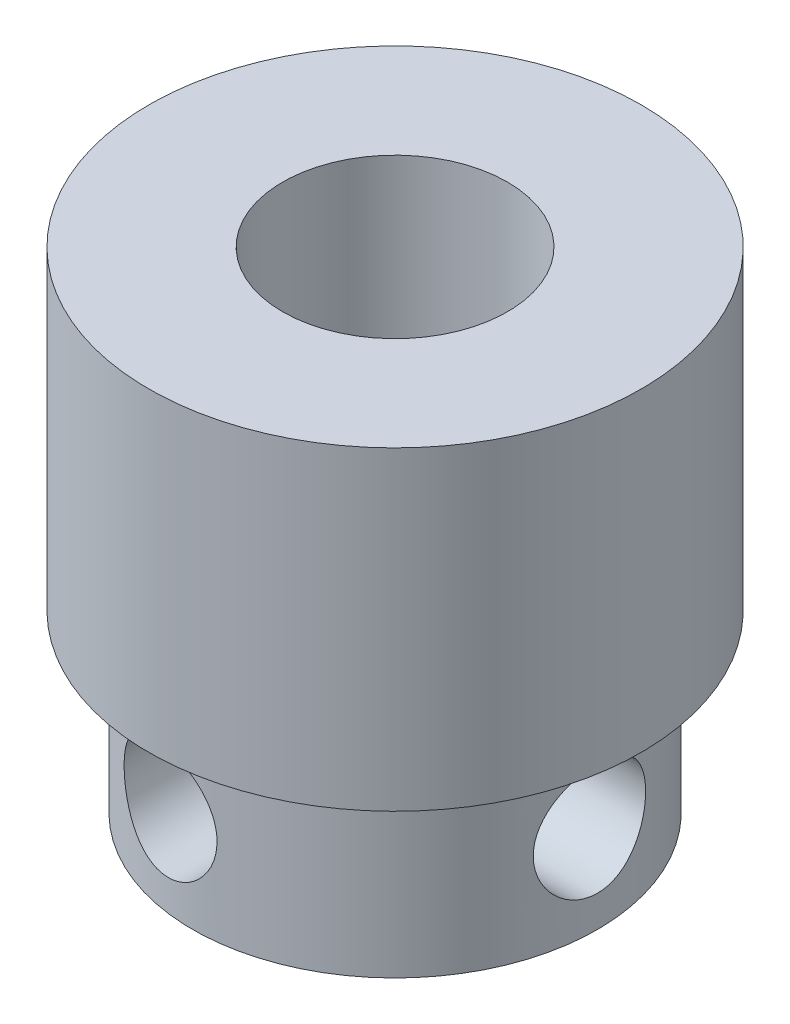
ISO-10303-21;
HEADER;
FILE_DESCRIPTION(('STEP AP214'),'2;1');
FILE_NAME('part.step','',(''),(''),'','','');
FILE_SCHEMA(('AUTOMOTIVE_DESIGN { 1 0 10303 214 1 1 1 1 }'));
ENDSEC;
DATA;
#1=APPLICATION_CONTEXT('core data for automotive mechanical design processes');
#2=APPLICATION_PROTOCOL_DEFINITION('international standard','automotive_design',2000,#1);
#3=PRODUCT_CONTEXT('',#1,'mechanical');
#4=PRODUCT('Part','Part','',(#3));
#5=PRODUCT_RELATED_PRODUCT_CATEGORY('part','',(#4));
#6=PRODUCT_DEFINITION_FORMATION('','',#4);
#7=PRODUCT_DEFINITION_CONTEXT('part definition',#1,'design');
#8=PRODUCT_DEFINITION('design','',#6,#7);
#9=PRODUCT_DEFINITION_SHAPE('','',#8);
#10=(LENGTH_UNIT() NAMED_UNIT(*) SI_UNIT(.MILLI.,.METRE.));
#11=(NAMED_UNIT(*) PLANE_ANGLE_UNIT() SI_UNIT($,.RADIAN.));
#12=(NAMED_UNIT(*) SI_UNIT($,.STERADIAN.) SOLID_ANGLE_UNIT());
#13=UNCERTAINTY_MEASURE_WITH_UNIT(LENGTH_MEASURE(1.E-05),#10,'distance_accuracy_value','');
#14=(GEOMETRIC_REPRESENTATION_CONTEXT(3) GLOBAL_UNCERTAINTY_ASSIGNED_CONTEXT((#13)) GLOBAL_UNIT_ASSIGNED_CONTEXT((#10,
#11,#12)) REPRESENTATION_CONTEXT('',''));
#15=CARTESIAN_POINT('',(0.,0.,0.));
#16=DIRECTION('',(0.,0.,1.));
#17=DIRECTION('',(1.,0.,0.));
#18=AXIS2_PLACEMENT_3D('',#15,#16,#17);
#19=CARTESIAN_POINT('',(74.7610003334919,47.4594238491086,-56.4));
#20=DIRECTION('',(0.,0.,1.));
#21=DIRECTION('',(1.,0.,0.));
#22=AXIS2_PLACEMENT_3D('',#19,#20,#21);
#23=CYLINDRICAL_SURFACE('',#22,1.25);
#24=CARTESIAN_POINT('',(76.0110003334919,47.4594238491086,-51.9291076216072));
#25=CARTESIAN_POINT('',(76.0109968876448,47.3893945585765,-51.9291056542091));
#26=CARTESIAN_POINT('',(76.0050929075244,47.319294653499,-51.9284201602777));
#27=CARTESIAN_POINT('',(75.9816245272522,47.1810183488735,-51.9258328790443));
#28=CARTESIAN_POINT('',(75.964040810737,47.1128453311288,-51.9239290770523));
#29=CARTESIAN_POINT('',(75.9177311494876,46.9804846795561,-51.9193707372766));
#30=CARTESIAN_POINT('',(75.8890154096498,46.9162934578928,-51.916716887675));
#31=CARTESIAN_POINT('',(75.8212578438801,46.7936443649985,-51.9113540049157));
#32=CARTESIAN_POINT('',(75.7822189833599,46.7351848538808,-51.9086449878111));
#33=CARTESIAN_POINT('',(75.6947158907752,46.6253842056303,-51.904000945872));
#34=CARTESIAN_POINT('',(75.6462151257433,46.5740720249095,-51.9020690128848));
#35=CARTESIAN_POINT('',(75.5412520619212,46.480312944112,-51.8998836400975));
#36=CARTESIAN_POINT('',(75.4847900348403,46.4378657416059,-51.8996301430284));
#37=CARTESIAN_POINT('',(75.3661535671145,46.3634571807049,-51.9016042389809));
#38=CARTESIAN_POINT('',(75.3040417313235,46.331395441756,-51.9038071063529));
#39=CARTESIAN_POINT('',(75.175510058751,46.2781025975286,-51.9112536247829));
#40=CARTESIAN_POINT('',(75.1090909765349,46.2568696009621,-51.9164967445052));
#41=CARTESIAN_POINT('',(74.9752947064598,46.2260542815144,-51.9301992755546));
#42=CARTESIAN_POINT('',(74.9079607413349,46.2162550378468,-51.9385946683251));
#43=CARTESIAN_POINT('',(74.7730725201406,46.207656061143,-51.9585784355283));
#44=CARTESIAN_POINT('',(74.7055182558669,46.2088567425489,-51.970166930251));
#45=CARTESIAN_POINT('',(74.5714202255809,46.2220309626674,-51.9963139848282));
#46=CARTESIAN_POINT('',(74.5048913996238,46.2341031551225,-52.0108987974069));
#47=CARTESIAN_POINT('',(74.375135176459,46.2685762401122,-52.0423467939815));
#48=CARTESIAN_POINT('',(74.3119085761436,46.2909796130612,-52.0592105244353));
#49=CARTESIAN_POINT('',(74.1871830466184,46.3467131703264,-52.0952434005359));
#50=CARTESIAN_POINT('',(74.1259200769064,46.3805244227761,-52.1144849801466));
#51=CARTESIAN_POINT('',(74.0099489880067,46.4577850797453,-52.1534136379601));
#52=CARTESIAN_POINT('',(73.9552430698262,46.5012377067102,-52.1731008631314));
#53=CARTESIAN_POINT('',(73.85141864528,46.598923218051,-52.2124712666208));
#54=CARTESIAN_POINT('',(73.8026506136307,46.6535454508218,-52.2321163662875));
#55=CARTESIAN_POINT('',(73.7150438186826,46.7710611303566,-52.2688747800963));
#56=CARTESIAN_POINT('',(73.6762081110398,46.8339571135298,-52.2859873144201));
#57=CARTESIAN_POINT('',(73.6108951510171,46.9645165272274,-52.3155738969584));
#58=CARTESIAN_POINT('',(73.5840933868734,47.03198982295,-52.3281676285));
#59=CARTESIAN_POINT('',(73.5425349448395,47.1711822955976,-52.3479791086481));
#60=CARTESIAN_POINT('',(73.5277420208419,47.242887989776,-52.355213028881));
#61=CARTESIAN_POINT('',(73.5165542138804,47.339272428073,-52.3606996521717));
#62=CARTESIAN_POINT('',(73.5144740789987,47.3632399920515,-52.3617220180127));
#63=CARTESIAN_POINT('',(73.511696408139,47.4112757507402,-52.3630888814258));
#64=CARTESIAN_POINT('',(73.5109989110963,47.4353439482651,-52.3634333599086));
#65=CARTESIAN_POINT('',(73.5110042191145,47.5252040051877,-52.3634286973932));
#66=CARTESIAN_POINT('',(73.5162237438078,47.5910714964902,-52.3608453131936));
#67=CARTESIAN_POINT('',(73.5368757773705,47.7208756717193,-52.3507693979481));
#68=CARTESIAN_POINT('',(73.5523297615832,47.7848079994055,-52.3432665445281));
#69=CARTESIAN_POINT('',(73.5927060918445,47.9086611176167,-52.3241292310281));
#70=CARTESIAN_POINT('',(73.6175921063422,47.968596276094,-52.3125106355969));
#71=CARTESIAN_POINT('',(73.6759332555568,48.0833435691813,-52.2861452208525));
#72=CARTESIAN_POINT('',(73.7093873768624,48.1381563086108,-52.2713987715284));
#73=CARTESIAN_POINT('',(73.7860657332033,48.2446307216534,-52.2389597388668));
#74=CARTESIAN_POINT('',(73.8297408249962,48.295930490219,-52.2211465752303));
#75=CARTESIAN_POINT('',(73.9245245530778,48.3907158253027,-52.1844977756597));
#76=CARTESIAN_POINT('',(73.9756364154496,48.4341979821326,-52.1656616982177));
#77=CARTESIAN_POINT('',(74.0884212099977,48.5155186782361,-52.1266793239855));
#78=CARTESIAN_POINT('',(74.1506062297883,48.5526558640688,-52.1065449850467));
#79=CARTESIAN_POINT('',(74.2808376614213,48.6157886689124,-52.0677655053738));
#80=CARTESIAN_POINT('',(74.3488843384259,48.641783783574,-52.0491204320827));
#81=CARTESIAN_POINT('',(74.4889744023463,48.6816324513465,-52.0144532272699));
#82=CARTESIAN_POINT('',(74.5610110177868,48.6955059434051,-51.9984268237243));
#83=CARTESIAN_POINT('',(74.7070630399979,48.7104125784813,-51.9697878223909));
#84=CARTESIAN_POINT('',(74.7810776462165,48.7114508397285,-51.9571738658046));
#85=CARTESIAN_POINT('',(74.9246579182614,48.7006392154587,-51.9363736826502));
#86=CARTESIAN_POINT('',(74.9942469164533,48.6894861440244,-51.9279842107348));
#87=CARTESIAN_POINT('',(75.1308595528583,48.6555238307632,-51.9146411007012));
#88=CARTESIAN_POINT('',(75.1978836489035,48.6327166797058,-51.9096868466723));
#89=CARTESIAN_POINT('',(75.3250380328934,48.577017900743,-51.9029664611108));
#90=CARTESIAN_POINT('',(75.3853252282236,48.5444954989865,-51.9010976632586));
#91=CARTESIAN_POINT('',(75.4997984222838,48.470037226087,-51.8996355095093));
#92=CARTESIAN_POINT('',(75.5539845063205,48.4281014865875,-51.9000421217929));
#93=CARTESIAN_POINT('',(75.6552082624022,48.3355722693778,-51.9023893913959));
#94=CARTESIAN_POINT('',(75.7021793546937,48.2849063621497,-51.9043434183218));
#95=CARTESIAN_POINT('',(75.7871535538603,48.1765378004439,-51.9089690212066));
#96=CARTESIAN_POINT('',(75.8251526591499,48.1188320234593,-51.9116409162093));
#97=CARTESIAN_POINT('',(75.8917800869141,47.9967926002611,-51.916959638651));
#98=CARTESIAN_POINT('',(75.9202136267534,47.9323526235071,-51.9196049897251));
#99=CARTESIAN_POINT('',(75.9658422014288,47.7996637109297,-51.9241176002132));
#100=CARTESIAN_POINT('',(75.9830557108152,47.7314212383676,-51.9259861368583));
#101=CARTESIAN_POINT('',(75.9999443600123,47.628762031761,-51.9278550286306));
#102=CARTESIAN_POINT('',(76.0040862543899,47.5950344598042,-51.9283218993077));
#103=CARTESIAN_POINT('',(76.0096150789814,47.5273514144995,-51.928948673228));
#104=CARTESIAN_POINT('',(76.0110020051158,47.4933959408143,-51.9291085760167));
#105=CARTESIAN_POINT('',(76.0110003334919,47.4594238491086,-51.9291076216072));
#106=B_SPLINE_CURVE_WITH_KNOTS('',3,(#24,#25,#26,#27,#28,#29,#30,#31,#32,#33,#34,#35,#36,#37,
#38,#39,#40,#41,#42,#43,#44,#45,#46,#47,#48,#49,#50,#51,#52,#53,#54,#55,#56,#57,#58,#59,#60,#61,
#62,#63,#64,#65,#66,#67,#68,#69,#70,#71,#72,#73,#74,#75,#76,#77,#78,#79,#80,#81,#82,#83,#84,#85,
#86,#87,#88,#89,#90,#91,#92,#93,#94,#95,#96,#97,#98,#99,#100,#101,#102,#103,#104,#105),
.UNSPECIFIED.,.T.,.F.,(4,2,2,2,2,2,2,2,2,2,2,2,2,2,2,2,2,2,2,2,2,2,2,2,2,2,2,2,2,2,2,2,2,2,2,2,
2,2,2,2,4),(0.,0.209961097101601,0.420270302794328,0.630387168988185,0.840443742617995,
1.05132800889075,1.26220507965181,1.47097848137552,1.6797154073978,1.88442425300143,
2.08914081141266,2.29573400380152,2.50237682302026,2.71913200440091,2.93595974148512,
3.16230115612892,3.38871212063435,3.60858454534661,3.8277908387609,3.89999253215297,
3.97219625872455,4.16943844980532,4.36709583839521,4.5639994768377,4.76087983682113,
4.96907028031586,5.17735130793067,5.40182131293736,5.62630147757269,5.85041169415689,
6.07443254074237,6.28628819583973,6.49810585686638,6.70272192004938,6.90733512190203,
7.11373572027292,7.32022820197043,7.53070164863907,7.74082765496704,7.84268227935644,
7.94453705456804),.UNSPECIFIED.);
#107=CARTESIAN_POINT('',(76.0110003334919,47.4594238491086,-51.9291076216072));
#108=VERTEX_POINT('',#107);
#109=EDGE_CURVE('E56',#108,#108,#106,.T.);
#110=ORIENTED_EDGE('',*,*,#109,.F.);
#111=EDGE_LOOP('',(#110));
#112=FACE_BOUND('',#111,.T.);
#113=CARTESIAN_POINT('',(73.5110003334919,47.4594238490951,-54.8854438516084));
#114=CARTESIAN_POINT('',(73.5110063077797,47.4131748024151,-54.8854326088886));
#115=CARTESIAN_POINT('',(73.5135948642836,47.3668692089976,-54.8820177292658));
#116=CARTESIAN_POINT('',(73.523722068673,47.2756691889072,-54.8688606149983));
#117=CARTESIAN_POINT('',(73.5312749472304,47.2307792090707,-54.8591001911624));
#118=CARTESIAN_POINT('',(73.5536317599848,47.130623435864,-54.8309057373385));
#119=CARTESIAN_POINT('',(73.5699128828592,47.076177145014,-54.8107671798782));
#120=CARTESIAN_POINT('',(73.608591314107,46.9720246062996,-54.7649236177248));
#121=CARTESIAN_POINT('',(73.6310027690586,46.922329685302,-54.7392057668054));
#122=CARTESIAN_POINT('',(73.6928195936888,46.8054487456234,-54.6716929332177));
#123=CARTESIAN_POINT('',(73.7352681919567,46.7409705666889,-54.6280092405778));
#124=CARTESIAN_POINT('',(73.8301247949933,46.6217002817254,-54.538332171151));
#125=CARTESIAN_POINT('',(73.882545385982,46.5669205872438,-54.4923359301301));
#126=CARTESIAN_POINT('',(73.9982027867437,46.4661133365865,-54.3999445961465));
#127=CARTESIAN_POINT('',(74.0616785728766,46.4203406947522,-54.353568590459));
#128=CARTESIAN_POINT('',(74.1978435528627,46.3406960762407,-54.2643528488368));
#129=CARTESIAN_POINT('',(74.2705166521208,46.3068036914489,-54.2215071463293));
#130=CARTESIAN_POINT('',(74.4083366138278,46.2584562516814,-54.1498834168401));
#131=CARTESIAN_POINT('',(74.47202000933,46.2414529935147,-54.1200147522788));
#132=CARTESIAN_POINT('',(74.6033382876731,46.2176161366652,-54.0652529336315));
#133=CARTESIAN_POINT('',(74.6709708220066,46.2107765565017,-54.0403568605731));
#134=CARTESIAN_POINT('',(74.8087804820709,46.2084281456025,-53.9963623336223));
#135=CARTESIAN_POINT('',(74.878970323478,46.2129867764649,-53.9772991509583));
#136=CARTESIAN_POINT('',(75.0189710643995,46.2342888338298,-53.945666214867));
#137=CARTESIAN_POINT('',(75.0887821084439,46.2510272272593,-53.9330937829183));
#138=CARTESIAN_POINT('',(75.2182940311632,46.2942771508421,-53.9151487484321));
#139=CARTESIAN_POINT('',(75.2783033576983,46.3196290820549,-53.9091765899769));
#140=CARTESIAN_POINT('',(75.3938477411587,46.3794992681168,-53.901583477871));
#141=CARTESIAN_POINT('',(75.4493828459141,46.4140174249606,-53.8999624776998));
#142=CARTESIAN_POINT('',(75.5541819440938,46.4911352157225,-53.9000387938067));
#143=CARTESIAN_POINT('',(75.6034680154039,46.5337049943771,-53.901724060297));
#144=CARTESIAN_POINT('',(75.6947915069537,46.6259086431089,-53.9071797414509));
#145=CARTESIAN_POINT('',(75.7368263418797,46.6755450212051,-53.9109508977981));
#146=CARTESIAN_POINT('',(75.8149398749143,46.7838278558983,-53.9195863873514));
#147=CARTESIAN_POINT('',(75.8505128762586,46.8428353897522,-53.9245025600125));
#148=CARTESIAN_POINT('',(75.9114998728944,46.9659015603856,-53.933904925704));
#149=CARTESIAN_POINT('',(75.9369169471791,47.0299586592161,-53.9383912487386));
#150=CARTESIAN_POINT('',(75.9747965778382,47.1545017070254,-53.9454330882004));
#151=CARTESIAN_POINT('',(75.9883431715866,47.2146511339918,-53.9481424011794));
#152=CARTESIAN_POINT('',(76.0064453451529,47.3363375557342,-53.9518172104984));
#153=CARTESIAN_POINT('',(76.0110017403861,47.3978744241564,-53.9527828649884));
#154=CARTESIAN_POINT('',(76.0109987391573,47.529173495357,-53.9527798344169));
#155=CARTESIAN_POINT('',(76.0051439701329,47.5989392668256,-53.9515362970108));
#156=CARTESIAN_POINT('',(75.9819080883324,47.7364677208908,-53.9468590443704));
#157=CARTESIAN_POINT('',(75.9645212633872,47.8042293934136,-53.9434242437707));
#158=CARTESIAN_POINT('',(75.9187744806038,47.9357672339992,-53.9352153104386));
#159=CARTESIAN_POINT('',(75.8904261741117,47.9995475506608,-53.930442601293));
#160=CARTESIAN_POINT('',(75.8235328821568,48.1215141134894,-53.9207936677326));
#161=CARTESIAN_POINT('',(75.7849867428759,48.1796997256358,-53.9159174316618));
#162=CARTESIAN_POINT('',(75.6981546396853,48.2896084905895,-53.9074798529718));
#163=CARTESIAN_POINT('',(75.6497529990795,48.3412418147022,-53.903935700529));
#164=CARTESIAN_POINT('',(75.5448611045892,48.435659783168,-53.8998531991656));
#165=CARTESIAN_POINT('',(75.4883733610532,48.4784471637242,-53.8993139194424));
#166=CARTESIAN_POINT('',(75.3709036832263,48.5526733996108,-53.9026664015225));
#167=CARTESIAN_POINT('',(75.3101133968519,48.5844208064579,-53.906422397275));
#168=CARTESIAN_POINT('',(75.1846435361056,48.6374130514185,-53.9191701546139));
#169=CARTESIAN_POINT('',(75.1199658339073,48.6586629003953,-53.928159413702));
#170=CARTESIAN_POINT('',(74.9927768067917,48.689390044938,-53.9511914079236));
#171=CARTESIAN_POINT('',(74.9303518765153,48.6994688685847,-53.9649171921559));
#172=CARTESIAN_POINT('',(74.8060146162023,48.7101713329096,-53.9973942730529));
#173=CARTESIAN_POINT('',(74.7441023520111,48.7107937772988,-54.0161462052502));
#174=CARTESIAN_POINT('',(74.6212563034678,48.7031420527161,-54.0586078397922));
#175=CARTESIAN_POINT('',(74.560364639453,48.6946954869234,-54.0824064606256));
#176=CARTESIAN_POINT('',(74.4420809967232,48.6695688574838,-54.1339512575647));
#177=CARTESIAN_POINT('',(74.3846900338206,48.6528864166498,-54.1616985717668));
#178=CARTESIAN_POINT('',(74.2670825937412,48.6096253681829,-54.2240185950703));
#179=CARTESIAN_POINT('',(74.2074582195269,48.58204704422,-54.2590099934516));
#180=CARTESIAN_POINT('',(74.0943239443803,48.5187875510181,-54.3315220437116));
#181=CARTESIAN_POINT('',(74.0408210220859,48.483097269594,-54.36904550628));
#182=CARTESIAN_POINT('',(73.9310178007313,48.3971632070119,-54.4522142451212));
#183=CARTESIAN_POINT('',(73.8760322120074,48.3454484422013,-54.4980774477178));
#184=CARTESIAN_POINT('',(73.7757218335361,48.2323680838606,-54.5885347405322));
#185=CARTESIAN_POINT('',(73.7303939813907,48.1710055603226,-54.633129229152));
#186=CARTESIAN_POINT('',(73.662869623778,48.0589708542099,-54.7039579198769));
#187=CARTESIAN_POINT('',(73.6378585350945,48.0108823066976,-54.7315980419784));
#188=CARTESIAN_POINT('',(73.5936641680491,47.9098190383016,-54.782282836922));
#189=CARTESIAN_POINT('',(73.5744711638487,47.8568526669311,-54.8053351565823));
#190=CARTESIAN_POINT('',(73.5465767170884,47.75884144019,-54.8397068689035));
#191=CARTESIAN_POINT('',(73.5364835799227,47.7147196572064,-54.8525011338029));
#192=CARTESIAN_POINT('',(73.5211012021467,47.6244308539271,-54.8722164071175));
#193=CARTESIAN_POINT('',(73.5157964242369,47.5782709620684,-54.8791564066569));
#194=CARTESIAN_POINT('',(73.5116983483726,47.5077110281502,-54.8845274424771));
#195=CARTESIAN_POINT('',(73.5109972137127,47.4835751485981,-54.8854497225682));
#196=CARTESIAN_POINT('',(73.5110003334919,47.4594238490951,-54.8854438516084));
#197=B_SPLINE_CURVE_WITH_KNOTS('',3,(#113,#114,#115,#116,#117,#118,#119,#120,#121,#122,#123,
#124,#125,#126,#127,#128,#129,#130,#131,#132,#133,#134,#135,#136,#137,#138,#139,#140,#141,#142,
#143,#144,#145,#146,#147,#148,#149,#150,#151,#152,#153,#154,#155,#156,#157,#158,#159,#160,#161,
#162,#163,#164,#165,#166,#167,#168,#169,#170,#171,#172,#173,#174,#175,#176,#177,#178,#179,#180,
#181,#182,#183,#184,#185,#186,#187,#188,#189,#190,#191,#192,#193,#194,#195,#196),.UNSPECIFIED.,
.T.,.F.,(4,2,2,2,2,2,2,2,2,2,2,2,2,2,2,2,2,2,2,2,2,2,2,2,2,2,2,2,2,2,2,2,2,2,2,2,2,2,2,2,2,4),
(0.,0.13866160050084,0.277722430627683,0.457579152018609,0.637854470742673,0.902556329992507,
1.16759452824165,1.43930186117183,1.7105401363872,1.92676016736033,2.1428528990608,
2.36022762382417,2.57751257327246,2.77282261336143,2.9681305652794,3.16272803373277,
3.35739474008492,3.56368835983777,3.76991938959156,3.9543866847975,4.13883724796107,
4.34786213391198,4.55699063348439,4.76589745134876,4.97482791576864,5.1863688616997,
5.39784427614137,5.60281579031647,5.80768936942453,6.00089537953214,6.19412583116003,
6.39109560167254,6.58812225843001,6.81059084820688,7.03331058358615,7.29724771603574,
7.56110103097328,7.74315304496699,7.92489903064442,8.06547953094184,8.20560221760924,
8.27801144728315),.UNSPECIFIED.);
#198=CARTESIAN_POINT('',(73.5110003334919,47.4594238490951,-54.8854438516084));
#199=VERTEX_POINT('',#198);
#200=EDGE_CURVE('E18',#199,#199,#197,.T.);
#201=ORIENTED_EDGE('',*,*,#200,.F.);
#202=EDGE_LOOP('',(#201));
#203=FACE_BOUND('',#202,.T.);
#204=ADVANCED_FACE('F14',(#112,#203),#23,.F.);
#205=CARTESIAN_POINT('',(88.5,47.47643198464,-56.4));
#206=DIRECTION('',(-1.,0.,0.));
#207=DIRECTION('',(0.,0.,1.));
#208=AXIS2_PLACEMENT_3D('',#205,#206,#207);
#209=CYLINDRICAL_SURFACE('',#208,1.25);
#210=CARTESIAN_POINT('',(80.,46.22643198464,-56.4));
#211=CARTESIAN_POINT('',(79.9999980947338,46.2264349510701,-56.3312300827288));
#212=CARTESIAN_POINT('',(79.9984073198217,46.2321287332399,-56.2624223133655));
#213=CARTESIAN_POINT('',(79.9922121515584,46.2547185147222,-56.1267717175999));
#214=CARTESIAN_POINT('',(79.9876049232365,46.2716250523773,-56.0599308015295));
#215=CARTESIAN_POINT('',(79.9758852023128,46.3160422572763,-55.9302267606125));
#216=CARTESIAN_POINT('',(79.9687765817579,46.3435365413203,-55.8673576639762));
#217=CARTESIAN_POINT('',(79.9528019895112,46.4082903534293,-55.747131561554));
#218=CARTESIAN_POINT('',(79.9439360903238,46.4455494786224,-55.6897743284964));
#219=CARTESIAN_POINT('',(79.9251525409537,46.5297569502839,-55.580758932648));
#220=CARTESIAN_POINT('',(79.9152157579437,46.5769039117515,-55.5292574887079));
#221=CARTESIAN_POINT('',(79.8955280780087,46.6791374565321,-55.4347705449232));
#222=CARTESIAN_POINT('',(79.8857772463038,46.7342267695731,-55.3917879850671));
#223=CARTESIAN_POINT('',(79.8673657951855,46.8520669733636,-55.3147728276018));
#224=CARTESIAN_POINT('',(79.8587297673434,46.9149449040411,-55.2809283843779));
#225=CARTESIAN_POINT('',(79.843822878859,47.0457383332532,-55.2243870144167));
#226=CARTESIAN_POINT('',(79.8375492090762,47.1136477329496,-55.2016768378668));
#227=CARTESIAN_POINT('',(79.8296015084016,47.2309802480181,-55.1733421861811));
#228=CARTESIAN_POINT('',(79.8271048038035,47.2796184325227,-55.1646049229313));
#229=CARTESIAN_POINT('',(79.8237553570694,47.3776418883726,-55.1529328954648));
#230=CARTESIAN_POINT('',(79.82290253055,47.4270271212394,-55.1499978334097));
#231=CARTESIAN_POINT('',(79.8229063221141,47.545144268757,-55.1500030132938));
#232=CARTESIAN_POINT('',(79.8245612387762,47.6138945246993,-55.1556875803461));
#233=CARTESIAN_POINT('',(79.830984620125,47.7494254613295,-55.1782374262576));
#234=CARTESIAN_POINT('',(79.8357560756215,47.8162041856156,-55.1951134453157));
#235=CARTESIAN_POINT('',(79.8478301468994,47.9457763910506,-55.2394414950371));
#236=CARTESIAN_POINT('',(79.8551285061126,48.0085763652761,-55.2668757489742));
#237=CARTESIAN_POINT('',(79.8714285161251,48.1286851139848,-55.3314879190582));
#238=CARTESIAN_POINT('',(79.8804301204764,48.1859940381461,-55.3686655695105));
#239=CARTESIAN_POINT('',(79.899396439288,48.2950571941288,-55.4527878796365));
#240=CARTESIAN_POINT('',(79.9093793465679,48.34664093895,-55.4999495126396));
#241=CARTESIAN_POINT('',(79.9290292146304,48.4412886689329,-55.6022477596137));
#242=CARTESIAN_POINT('',(79.9386960749418,48.4843499663803,-55.657386879976));
#243=CARTESIAN_POINT('',(79.9568305458672,48.5614531862358,-55.7752773364821));
#244=CARTESIAN_POINT('',(79.9652736054931,48.5953199529971,-55.8381472169432));
#245=CARTESIAN_POINT('',(79.9797860316814,48.6519049055633,-55.9689237157136));
#246=CARTESIAN_POINT('',(79.9858581593288,48.6746360673187,-56.036824365059));
#247=CARTESIAN_POINT('',(79.9935411754654,48.7030253222668,-56.1542112947803));
#248=CARTESIAN_POINT('',(79.9959504205761,48.7117869209323,-56.202917385169));
#249=CARTESIAN_POINT('',(79.9991804829363,48.7234911901146,-56.3010758095315));
#250=CARTESIAN_POINT('',(80.0000013706156,48.7264341186386,-56.3505281103195));
#251=CARTESIAN_POINT('',(79.9999980947338,48.7264290182099,-56.4687699172712));
#252=CARTESIAN_POINT('',(79.9984073198217,48.7207352360401,-56.5375776866345));
#253=CARTESIAN_POINT('',(79.9922121515584,48.6981454545578,-56.6732282824001));
#254=CARTESIAN_POINT('',(79.9876049232365,48.6812389169027,-56.7400691984705));
#255=CARTESIAN_POINT('',(79.9758852023128,48.6368217120037,-56.8697732393875));
#256=CARTESIAN_POINT('',(79.9687765817579,48.6093274279597,-56.9326423360238));
#257=CARTESIAN_POINT('',(79.9528019895112,48.5445736158507,-57.052868438446));
#258=CARTESIAN_POINT('',(79.9439360903238,48.5073144906576,-57.1102256715036));
#259=CARTESIAN_POINT('',(79.9251525409537,48.4231070189961,-57.219241067352));
#260=CARTESIAN_POINT('',(79.9152157579437,48.3759600575285,-57.270742511292));
#261=CARTESIAN_POINT('',(79.8955280780087,48.2737265127479,-57.3652294550768));
#262=CARTESIAN_POINT('',(79.8857772463039,48.2186371997069,-57.4082120149329));
#263=CARTESIAN_POINT('',(79.8673657951855,48.1007969959164,-57.4852271723982));
#264=CARTESIAN_POINT('',(79.8587297673434,48.0379190652389,-57.5190716156221));
#265=CARTESIAN_POINT('',(79.843822878859,47.9071256360268,-57.5756129855833));
#266=CARTESIAN_POINT('',(79.8375492090762,47.8392162363304,-57.5983231621332));
#267=CARTESIAN_POINT('',(79.8296015084016,47.721883721262,-57.6266578138189));
#268=CARTESIAN_POINT('',(79.8271048038035,47.6732455367574,-57.6353950770687));
#269=CARTESIAN_POINT('',(79.8237553570694,47.5752220809074,-57.6470671045352));
#270=CARTESIAN_POINT('',(79.82290253055,47.5258368480406,-57.6500021665903));
#271=CARTESIAN_POINT('',(79.8229063221141,47.407719700523,-57.6499969867062));
#272=CARTESIAN_POINT('',(79.8245612387762,47.3389694445807,-57.6443124196539));
#273=CARTESIAN_POINT('',(79.830984620125,47.2034385079505,-57.6217625737424));
#274=CARTESIAN_POINT('',(79.8357560756215,47.1366597836644,-57.6048865546843));
#275=CARTESIAN_POINT('',(79.8478301468994,47.0070875782294,-57.5605585049629));
#276=CARTESIAN_POINT('',(79.8551285061126,46.9442876040039,-57.5331242510258));
#277=CARTESIAN_POINT('',(79.8714285161251,46.8241788552953,-57.4685120809418));
#278=CARTESIAN_POINT('',(79.8804301204764,46.7668699311339,-57.4313344304895));
#279=CARTESIAN_POINT('',(79.899396439288,46.6578067751512,-57.3472121203635));
#280=CARTESIAN_POINT('',(79.9093793465679,46.60622303033,-57.3000504873604));
#281=CARTESIAN_POINT('',(79.9290292146304,46.5115753003471,-57.1977522403863));
#282=CARTESIAN_POINT('',(79.9386960749418,46.4685140028997,-57.142613120024));
#283=CARTESIAN_POINT('',(79.9568305458672,46.3914107830442,-57.0247226635179));
#284=CARTESIAN_POINT('',(79.9652736054931,46.3575440162829,-56.9618527830568));
#285=CARTESIAN_POINT('',(79.9797860316814,46.3009590637167,-56.8310762842864));
#286=CARTESIAN_POINT('',(79.9858581593289,46.2782279019613,-56.763175634941));
#287=CARTESIAN_POINT('',(79.9935411754654,46.2498386470132,-56.6457887052197));
#288=CARTESIAN_POINT('',(79.9959504205761,46.2410770483477,-56.597082614831));
#289=CARTESIAN_POINT('',(79.9991804829363,46.2293727791654,-56.4989241904685));
#290=CARTESIAN_POINT('',(80.0000013706156,46.2264298506415,-56.4494718896805));
#291=CARTESIAN_POINT('',(80.,46.22643198464,-56.4));
#292=B_SPLINE_CURVE_WITH_KNOTS('',3,(#210,#211,#212,#213,#214,#215,#216,#217,#218,#219,#220,
#221,#222,#223,#224,#225,#226,#227,#228,#229,#230,#231,#232,#233,#234,#235,#236,#237,#238,#239,
#240,#241,#242,#243,#244,#245,#246,#247,#248,#249,#250,#251,#252,#253,#254,#255,#256,#257,#258,
#259,#260,#261,#262,#263,#264,#265,#266,#267,#268,#269,#270,#271,#272,#273,#274,#275,#276,#277,
#278,#279,#280,#281,#282,#283,#284,#285,#286,#287,#288,#289,#290,#291),.UNSPECIFIED.,.T.,.F.,(4,
2,2,2,2,2,2,2,2,2,2,2,2,2,2,2,2,2,2,2,2,2,2,2,2,2,2,2,2,2,2,2,2,2,2,2,2,2,2,2,4),(0.,
0.206125692883217,0.412445388681671,0.618447105388922,0.82444032433698,1.03505476802259,
1.24574177167679,1.46048330585181,1.67496867288519,1.82305827501902,1.9711402752267,
2.17709272141383,2.38324310236958,2.58904789915711,2.79484708439858,3.00568828461707,
3.21659587199806,3.43127693900778,3.64570724670524,3.79399708244154,3.94228034267023,
4.14840603555345,4.35472573135191,4.56072744805916,4.76672066700722,4.97733511069282,
5.18802211434701,5.40276364852205,5.61724901555543,5.76533861768926,5.91342061789696,
6.11937306408408,6.32552344503984,6.53132824182737,6.73712742706883,6.94796862728732,
7.15887621466831,7.37355728167804,7.58798758937549,7.73627742511182,7.8845606853405),.UNSPECIFIED.);
#293=CARTESIAN_POINT('',(80.,46.22643198464,-56.4));
#294=VERTEX_POINT('',#293);
#295=EDGE_CURVE('E49',#294,#294,#292,.T.);
#296=ORIENTED_EDGE('',*,*,#295,.F.);
#297=EDGE_LOOP('',(#296));
#298=FACE_BOUND('',#297,.T.);
#299=CARTESIAN_POINT('',(77.6650635094611,47.4764319846409,-57.65));
#300=CARTESIAN_POINT('',(77.6650661431314,47.5416450686549,-57.6499979967552));
#301=CARTESIAN_POINT('',(77.6680504708273,47.6068747005103,-57.6448692361454));
#302=CARTESIAN_POINT('',(77.6795408667052,47.7352840982247,-57.6246346714729));
#303=CARTESIAN_POINT('',(77.688051726798,47.7984620351494,-57.6095202088724));
#304=CARTESIAN_POINT('',(77.7093653505907,47.9207419047412,-57.5701274777074));
#305=CARTESIAN_POINT('',(77.7221474247982,47.9798618611027,-57.545893314341));
#306=CARTESIAN_POINT('',(77.7505296345113,48.0931985543912,-57.4890921273345));
#307=CARTESIAN_POINT('',(77.7661305938707,48.1474138509013,-57.4565226664398));
#308=CARTESIAN_POINT('',(77.7999602805696,48.2543125640913,-57.3808345409658));
#309=CARTESIAN_POINT('',(77.8182996042182,48.3065025462227,-57.3370682074307));
#310=CARTESIAN_POINT('',(77.8546486211137,48.4031895631171,-57.2415702854395));
#311=CARTESIAN_POINT('',(77.8726581233987,48.447682259791,-57.1898342362033));
#312=CARTESIAN_POINT('',(77.9077745076169,48.530655079972,-57.0755935764769));
#313=CARTESIAN_POINT('',(77.9247376434181,48.5685238836408,-57.0125969476721));
#314=CARTESIAN_POINT('',(77.9543930057265,48.6328764708225,-56.8801446342884));
#315=CARTESIAN_POINT('',(77.9670907506041,48.659374977128,-56.8106974448868));
#316=CARTESIAN_POINT('',(77.984399360491,48.6950040020739,-56.6843040555283));
#317=CARTESIAN_POINT('',(77.9902087195611,48.7067510186347,-56.62824880854));
#318=CARTESIAN_POINT('',(77.9980091770734,48.7224646590457,-56.514799610445));
#319=CARTESIAN_POINT('',(78.0000013641589,48.7264335012102,-56.4574060457495));
#320=CARTESIAN_POINT('',(77.9999984365238,48.7264302464837,-56.3342063548431));
#321=CARTESIAN_POINT('',(77.9973782074992,48.7212131712936,-56.2683963149703));
#322=CARTESIAN_POINT('',(77.9871665558697,48.7005952069436,-56.138776098848));
#323=CARTESIAN_POINT('',(77.9795721519439,48.6851882102992,-56.0749671460192));
#324=CARTESIAN_POINT('',(77.9602049184061,48.6449425755869,-55.9513387827254));
#325=CARTESIAN_POINT('',(77.9484461587579,48.6201356771362,-55.8915067343309));
#326=CARTESIAN_POINT('',(77.9218261157462,48.56197749923,-55.7769244545976));
#327=CARTESIAN_POINT('',(77.9069642550367,48.528624629495,-55.7221751716726));
#328=CARTESIAN_POINT('',(77.8744537388957,48.4520367167548,-55.6156166826214));
#329=CARTESIAN_POINT('',(77.8566910536726,48.408326904607,-55.56418407775));
#330=CARTESIAN_POINT('',(77.8207507345978,48.3132828559481,-55.4690283480346));
#331=CARTESIAN_POINT('',(77.8025727730309,48.2619424085251,-55.425311567448));
#332=CARTESIAN_POINT('',(77.7662298893479,48.1483075733639,-55.3434194823507));
#333=CARTESIAN_POINT('',(77.7481763374077,48.0854713838322,-55.3059413371985));
#334=CARTESIAN_POINT('',(77.7160644301372,47.9534154718817,-55.242269521408));
#335=CARTESIAN_POINT('',(77.7020003068594,47.8842051591312,-55.2160595305998));
#336=CARTESIAN_POINT('',(77.6826975168178,47.7584832734411,-55.1809307537765));
#337=CARTESIAN_POINT('',(77.6761516550155,47.7029024280387,-55.1693736372681));
#338=CARTESIAN_POINT('',(77.6673345666442,47.5903621252799,-55.1539092925745));
#339=CARTESIAN_POINT('',(77.6650612086369,47.5334033696992,-55.1499982499274));
#340=CARTESIAN_POINT('',(77.6650661431314,47.4112189006257,-55.1500020032448));
#341=CARTESIAN_POINT('',(77.6680504708272,47.3459892687704,-55.1551307638545));
#342=CARTESIAN_POINT('',(77.6795408667051,47.2175798710559,-55.175365328527));
#343=CARTESIAN_POINT('',(77.6880517267979,47.1544019341312,-55.1904797911274));
#344=CARTESIAN_POINT('',(77.7093653505906,47.0321220645395,-55.2298725222924));
#345=CARTESIAN_POINT('',(77.722147424798,46.973002108178,-55.2541066856587));
#346=CARTESIAN_POINT('',(77.7505296345111,46.8596654148894,-55.3109078726651));
#347=CARTESIAN_POINT('',(77.7661305938705,46.8054501183793,-55.3434773335598));
#348=CARTESIAN_POINT('',(77.7999602805694,46.6985514051892,-55.4191654590337));
#349=CARTESIAN_POINT('',(77.818299604218,46.6463614230579,-55.4629317925687));
#350=CARTESIAN_POINT('',(77.8546486211135,46.5496744061634,-55.5584297145599));
#351=CARTESIAN_POINT('',(77.8726581233985,46.5051817094895,-55.6101657637961));
#352=CARTESIAN_POINT('',(77.9077745076167,46.4222088893084,-55.7244064235224));
#353=CARTESIAN_POINT('',(77.9247376434179,46.3843400856396,-55.7874030523272));
#354=CARTESIAN_POINT('',(77.9543930057263,46.3199874984578,-55.9198553657108));
#355=CARTESIAN_POINT('',(77.9670907506039,46.2934889921523,-55.9893025551124));
#356=CARTESIAN_POINT('',(77.9843993604909,46.2578599672062,-56.115695944471));
#357=CARTESIAN_POINT('',(77.9902087195611,46.2461129506454,-56.1717511914594));
#358=CARTESIAN_POINT('',(77.9980091770733,46.2303993102343,-56.2852003895547));
#359=CARTESIAN_POINT('',(78.0000013641589,46.2264304680698,-56.3425939542503));
#360=CARTESIAN_POINT('',(77.9999984365238,46.2264337227963,-56.4657936451569));
#361=CARTESIAN_POINT('',(77.9973782074991,46.2316507979864,-56.5316036850297));
#362=CARTESIAN_POINT('',(77.9871665558697,46.2522687623364,-56.6612239011519));
#363=CARTESIAN_POINT('',(77.9795721519439,46.2676757589808,-56.7250328539808));
#364=CARTESIAN_POINT('',(77.9602049184061,46.3079213936931,-56.8486612172746));
#365=CARTESIAN_POINT('',(77.9484461587579,46.3327282921438,-56.908493265669));
#366=CARTESIAN_POINT('',(77.9218261157462,46.39088647005,-57.0230755454024));
#367=CARTESIAN_POINT('',(77.9069642550367,46.424239339785,-57.0778248283274));
#368=CARTESIAN_POINT('',(77.8744537388957,46.5008272525251,-57.1843833173786));
#369=CARTESIAN_POINT('',(77.8566910536726,46.544537064673,-57.23581592225));
#370=CARTESIAN_POINT('',(77.8207507345978,46.6395811133319,-57.3309716519654));
#371=CARTESIAN_POINT('',(77.8025727730309,46.6909215607549,-57.374688432552));
#372=CARTESIAN_POINT('',(77.7662298893479,46.8045563959161,-57.4565805176493));
#373=CARTESIAN_POINT('',(77.7481763374077,46.8673925854477,-57.4940586628015));
#374=CARTESIAN_POINT('',(77.7160644301372,46.9994484973983,-57.557730478592));
#375=CARTESIAN_POINT('',(77.7020003068594,47.0686588101488,-57.5839404694002));
#376=CARTESIAN_POINT('',(77.6826975168177,47.194380695839,-57.6190692462236));
#377=CARTESIAN_POINT('',(77.6761516550155,47.2499615412415,-57.6306263627319));
#378=CARTESIAN_POINT('',(77.6673345666442,47.3625018440005,-57.6460907074256));
#379=CARTESIAN_POINT('',(77.6650612086368,47.4194605995813,-57.6500017500726));
#380=CARTESIAN_POINT('',(77.6650635094611,47.4764319846409,-57.65));
#381=B_SPLINE_CURVE_WITH_KNOTS('',3,(#299,#300,#301,#302,#303,#304,#305,#306,#307,#308,#309,
#310,#311,#312,#313,#314,#315,#316,#317,#318,#319,#320,#321,#322,#323,#324,#325,#326,#327,#328,
#329,#330,#331,#332,#333,#334,#335,#336,#337,#338,#339,#340,#341,#342,#343,#344,#345,#346,#347,
#348,#349,#350,#351,#352,#353,#354,#355,#356,#357,#358,#359,#360,#361,#362,#363,#364,#365,#366,
#367,#368,#369,#370,#371,#372,#373,#374,#375,#376,#377,#378,#379,#380),.UNSPECIFIED.,.T.,.F.,(4,
2,2,2,2,2,2,2,2,2,2,2,2,2,2,2,2,2,2,2,2,2,2,2,2,2,2,2,2,2,2,2,2,2,2,2,2,2,2,2,4),(0.,
0.195410713907845,0.390991089955449,0.585637498153429,0.780340886435271,0.991071061904195,
1.20191961795359,1.42704867624457,1.65188534073216,1.82395843463624,1.9959824466184,
2.19314089317311,2.39041761686269,2.58703406947156,2.78368713611484,2.99220335459571,
3.20089023265962,3.42583697797442,3.65045681623692,3.82125654624914,3.99197104618618,
4.18738176009399,4.38296213614156,4.57760854433952,4.77231193262133,4.9830421080902,
5.19389066413955,5.41901972243053,5.64385638691812,5.81592948082262,5.9879534928052,
6.18511193935991,6.38238866304948,6.57900511565836,6.77565818230164,6.98417440078251,
7.19286127884641,7.41780802416121,7.64242786242371,7.81322759243625,7.98394209237361),.UNSPECIFIED.);
#382=CARTESIAN_POINT('',(77.6650635094611,47.4764319846409,-57.65));
#383=VERTEX_POINT('',#382);
#384=EDGE_CURVE('E77',#383,#383,#381,.T.);
#385=ORIENTED_EDGE('',*,*,#384,.F.);
#386=EDGE_LOOP('',(#385));
#387=FACE_BOUND('',#386,.T.);
#388=ADVANCED_FACE('F60',(#298,#387),#209,.F.);
#389=CARTESIAN_POINT('',(75.5,45.52643198464,-56.4));
#390=DIRECTION('',(0.,-1.,0.));
#391=DIRECTION('',(0.,0.,-1.));
#392=AXIS2_PLACEMENT_3D('',#389,#390,#391);
#393=PLANE('',#392);
#394=CARTESIAN_POINT('',(75.5,45.52643198464,-56.4));
#395=DIRECTION('',(0.,-1.,0.));
#396=DIRECTION('',(0.,0.,-1.));
#397=AXIS2_PLACEMENT_3D('',#394,#395,#396);
#398=CIRCLE('',#397,2.5);
#399=CARTESIAN_POINT('',(75.5,45.52643198464,-58.9));
#400=VERTEX_POINT('',#399);
#401=EDGE_CURVE('E82',#400,#400,#398,.F.);
#402=ORIENTED_EDGE('',*,*,#401,.T.);
#403=EDGE_LOOP('',(#402));
#404=FACE_BOUND('',#403,.T.);
#405=CARTESIAN_POINT('',(75.5,45.52643198464,-56.4));
#406=DIRECTION('',(0.,-1.,0.));
#407=DIRECTION('',(0.,0.,-1.));
#408=AXIS2_PLACEMENT_3D('',#405,#406,#407);
#409=CIRCLE('',#408,4.5);
#410=CARTESIAN_POINT('',(75.5,45.52643198464,-60.9));
#411=VERTEX_POINT('',#410);
#412=EDGE_CURVE('E45',#411,#411,#409,.F.);
#413=ORIENTED_EDGE('',*,*,#412,.F.);
#414=EDGE_LOOP('',(#413));
#415=FACE_BOUND('',#414,.T.);
#416=ADVANCED_FACE('F74',(#404,#415),#393,.T.);
#417=CARTESIAN_POINT('',(75.5,56.97143198464,-56.4));
#418=DIRECTION('',(0.,-1.,0.));
#419=DIRECTION('',(0.,0.,-1.));
#420=AXIS2_PLACEMENT_3D('',#417,#418,#419);
#421=CYLINDRICAL_SURFACE('',#420,2.5);
#422=ORIENTED_EDGE('',*,*,#401,.F.);
#423=EDGE_LOOP('',(#422));
#424=FACE_BOUND('',#423,.T.);
#425=ORIENTED_EDGE('',*,*,#384,.T.);
#426=EDGE_LOOP('',(#425));
#427=FACE_BOUND('',#426,.T.);
#428=CARTESIAN_POINT('',(75.5,56.42643198464,-56.4));
#429=DIRECTION('',(0.,-1.,0.));
#430=DIRECTION('',(0.,0.,-1.));
#431=AXIS2_PLACEMENT_3D('',#428,#429,#430);
#432=CIRCLE('',#431,2.5);
#433=CARTESIAN_POINT('',(75.5,56.42643198464,-58.9));
#434=VERTEX_POINT('',#433);
#435=EDGE_CURVE('E41',#434,#434,#432,.F.);
#436=ORIENTED_EDGE('',*,*,#435,.T.);
#437=EDGE_LOOP('',(#436));
#438=FACE_BOUND('',#437,.T.);
#439=ORIENTED_EDGE('',*,*,#200,.T.);
#440=EDGE_LOOP('',(#439));
#441=FACE_BOUND('',#440,.T.);
#442=ADVANCED_FACE('F68',(#424,#427,#438,#441),#421,.F.);
#443=CARTESIAN_POINT('',(75.5,56.97143198464,-56.4));
#444=DIRECTION('',(0.,-1.,0.));
#445=DIRECTION('',(0.,0.,-1.));
#446=AXIS2_PLACEMENT_3D('',#443,#444,#445);
#447=CYLINDRICAL_SURFACE('',#446,4.5);
#448=ORIENTED_EDGE('',*,*,#295,.T.);
#449=EDGE_LOOP('',(#448));
#450=FACE_BOUND('',#449,.T.);
#451=CARTESIAN_POINT('',(75.5,49.42643198464,-56.4));
#452=DIRECTION('',(0.,-1.,0.));
#453=DIRECTION('',(0.,0.,-1.));
#454=AXIS2_PLACEMENT_3D('',#451,#452,#453);
#455=CIRCLE('',#454,4.5);
#456=CARTESIAN_POINT('',(75.5,49.42643198464,-60.9));
#457=VERTEX_POINT('',#456);
#458=EDGE_CURVE('E35',#457,#457,#455,.F.);
#459=ORIENTED_EDGE('',*,*,#458,.F.);
#460=EDGE_LOOP('',(#459));
#461=FACE_BOUND('',#460,.T.);
#462=ORIENTED_EDGE('',*,*,#412,.T.);
#463=EDGE_LOOP('',(#462));
#464=FACE_BOUND('',#463,.T.);
#465=ORIENTED_EDGE('',*,*,#109,.T.);
#466=EDGE_LOOP('',(#465));
#467=FACE_BOUND('',#466,.T.);
#468=ADVANCED_FACE('F63',(#450,#461,#464,#467),#447,.T.);
#469=CARTESIAN_POINT('',(75.5,56.42643198464,-56.4));
#470=DIRECTION('',(0.,-1.,0.));
#471=DIRECTION('',(0.,0.,-1.));
#472=AXIS2_PLACEMENT_3D('',#469,#470,#471);
#473=PLANE('',#472);
#474=ORIENTED_EDGE('',*,*,#435,.F.);
#475=EDGE_LOOP('',(#474));
#476=FACE_BOUND('',#475,.T.);
#477=CARTESIAN_POINT('',(75.5,56.42643198464,-56.4));
#478=DIRECTION('',(0.,-1.,0.));
#479=DIRECTION('',(0.,0.,-1.));
#480=AXIS2_PLACEMENT_3D('',#477,#478,#479);
#481=CIRCLE('',#480,5.47499999999999);
#482=CARTESIAN_POINT('',(75.5,56.42643198464,-61.875));
#483=VERTEX_POINT('',#482);
#484=EDGE_CURVE('E26',#483,#483,#481,.T.);
#485=ORIENTED_EDGE('',*,*,#484,.F.);
#486=EDGE_LOOP('',(#485));
#487=FACE_BOUND('',#486,.T.);
#488=ADVANCED_FACE('F67',(#476,#487),#473,.F.);
#489=CARTESIAN_POINT('',(75.5,49.42643198464,-56.4));
#490=DIRECTION('',(0.,-1.,0.));
#491=DIRECTION('',(0.,0.,-1.));
#492=AXIS2_PLACEMENT_3D('',#489,#490,#491);
#493=PLANE('',#492);
#494=ORIENTED_EDGE('',*,*,#458,.T.);
#495=EDGE_LOOP('',(#494));
#496=FACE_BOUND('',#495,.T.);
#497=CARTESIAN_POINT('',(75.5,49.42643198464,-56.4));
#498=DIRECTION('',(0.,-1.,0.));
#499=DIRECTION('',(0.,0.,-1.));
#500=AXIS2_PLACEMENT_3D('',#497,#498,#499);
#501=CIRCLE('',#500,5.47499999999999);
#502=CARTESIAN_POINT('',(75.5,49.42643198464,-61.875));
#503=VERTEX_POINT('',#502);
#504=EDGE_CURVE('E10',#503,#503,#501,.F.);
#505=ORIENTED_EDGE('',*,*,#504,.F.);
#506=EDGE_LOOP('',(#505));
#507=FACE_BOUND('',#506,.T.);
#508=ADVANCED_FACE('F111',(#496,#507),#493,.T.);
#509=CARTESIAN_POINT('',(75.5,56.97143198464,-56.4));
#510=DIRECTION('',(0.,-1.,0.));
#511=DIRECTION('',(0.,0.,-1.));
#512=AXIS2_PLACEMENT_3D('',#509,#510,#511);
#513=CYLINDRICAL_SURFACE('',#512,5.47499999999999);
#514=ORIENTED_EDGE('',*,*,#484,.T.);
#515=EDGE_LOOP('',(#514));
#516=FACE_BOUND('',#515,.T.);
#517=ORIENTED_EDGE('',*,*,#504,.T.);
#518=EDGE_LOOP('',(#517));
#519=FACE_BOUND('',#518,.T.);
#520=ADVANCED_FACE('F109',(#516,#519),#513,.T.);
#521=CLOSED_SHELL('',(#204,#388,#416,#442,#468,#488,#508,#520));
#522=MANIFOLD_SOLID_BREP('B1',#521);
#523=ADVANCED_BREP_SHAPE_REPRESENTATION('',(#18,#522),#14);
#524=SHAPE_DEFINITION_REPRESENTATION(#9,#523);
ENDSEC;
END-ISO-10303-21;
